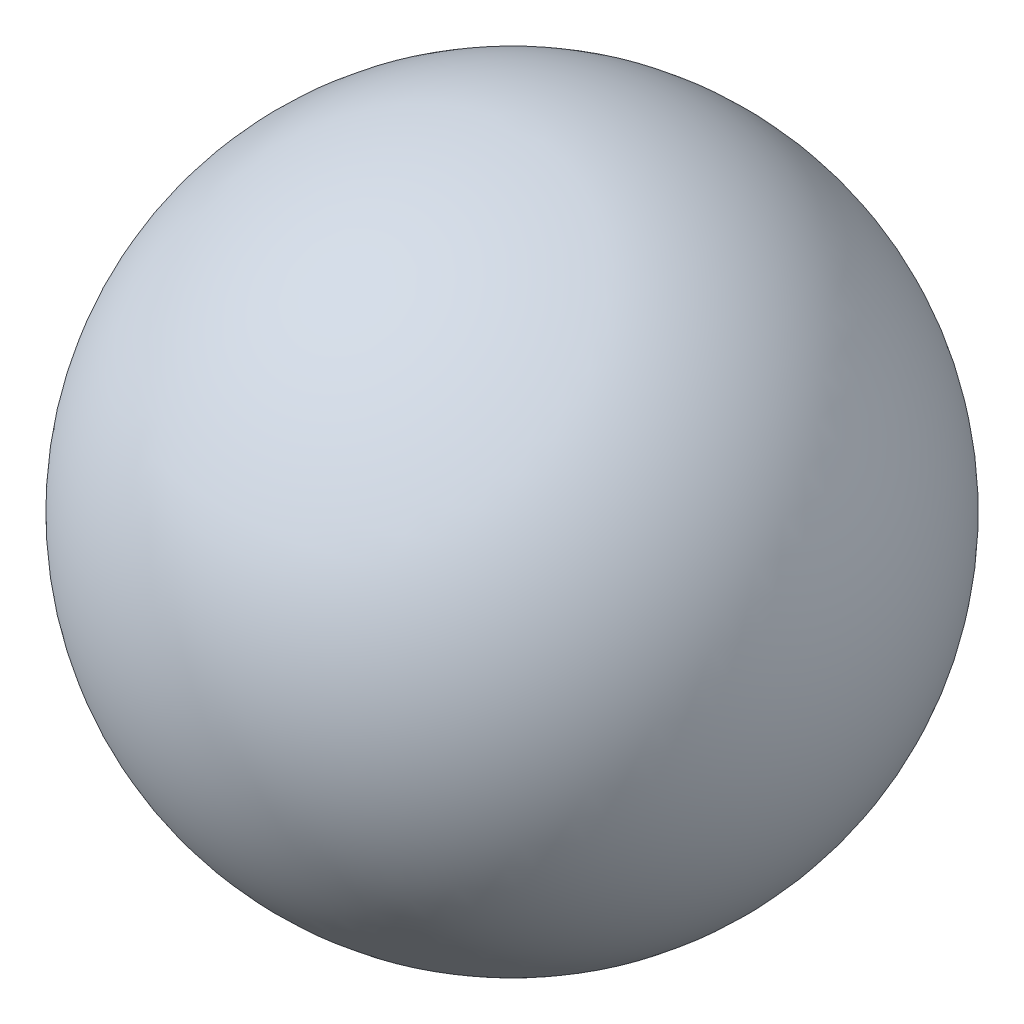
ISO-10303-21;
HEADER;
FILE_DESCRIPTION(('STEP AP214'),'2;1');
FILE_NAME('part.step','',(''),(''),'','','');
FILE_SCHEMA(('AUTOMOTIVE_DESIGN { 1 0 10303 214 1 1 1 1 }'));
ENDSEC;
DATA;
#1=APPLICATION_CONTEXT('core data for automotive mechanical design processes');
#2=APPLICATION_PROTOCOL_DEFINITION('international standard','automotive_design',2000,#1);
#3=PRODUCT_CONTEXT('',#1,'mechanical');
#4=PRODUCT('Part','Part','',(#3));
#5=PRODUCT_RELATED_PRODUCT_CATEGORY('part','',(#4));
#6=PRODUCT_DEFINITION_FORMATION('','',#4);
#7=PRODUCT_DEFINITION_CONTEXT('part definition',#1,'design');
#8=PRODUCT_DEFINITION('design','',#6,#7);
#9=PRODUCT_DEFINITION_SHAPE('','',#8);
#10=(LENGTH_UNIT() NAMED_UNIT(*) SI_UNIT(.MILLI.,.METRE.));
#11=(NAMED_UNIT(*) PLANE_ANGLE_UNIT() SI_UNIT($,.RADIAN.));
#12=(NAMED_UNIT(*) SI_UNIT($,.STERADIAN.) SOLID_ANGLE_UNIT());
#13=UNCERTAINTY_MEASURE_WITH_UNIT(LENGTH_MEASURE(1.E-05),#10,'distance_accuracy_value','');
#14=(GEOMETRIC_REPRESENTATION_CONTEXT(3) GLOBAL_UNCERTAINTY_ASSIGNED_CONTEXT((#13)) GLOBAL_UNIT_ASSIGNED_CONTEXT((#10,
#11,#12)) REPRESENTATION_CONTEXT('',''));
#15=CARTESIAN_POINT('',(0.,0.,0.));
#16=DIRECTION('',(0.,0.,1.));
#17=DIRECTION('',(1.,0.,0.));
#18=AXIS2_PLACEMENT_3D('',#15,#16,#17);
#19=CARTESIAN_POINT('',(0.,0.,0.));
#20=DIRECTION('',(0.,1.,0.));
#21=DIRECTION('',(1.,0.,0.));
#22=AXIS2_PLACEMENT_3D('',#19,#20,#21);
#23=SPHERICAL_SURFACE('',#22,36.5);
#24=CARTESIAN_POINT('',(0.,36.5,0.));
#25=VERTEX_POINT('',#24);
#26=VERTEX_LOOP('',#25);
#27=FACE_BOUND('',#26,.T.);
#28=ADVANCED_FACE('F30',(#27),#23,.T.);
#29=CLOSED_SHELL('',(#28));
#30=CARTESIAN_POINT('',(0.,0.,0.));
#31=DIRECTION('',(0.,1.,0.));
#32=DIRECTION('',(1.,0.,0.));
#33=AXIS2_PLACEMENT_3D('',#30,#31,#32);
#34=SPHERICAL_SURFACE('',#33,34.1);
#35=CARTESIAN_POINT('',(0.,34.1,0.));
#36=VERTEX_POINT('',#35);
#37=VERTEX_LOOP('',#36);
#38=FACE_BOUND('',#37,.T.);
#39=ADVANCED_FACE('F32',(#38),#34,.F.);
#40=CLOSED_SHELL('',(#39));
#41=ORIENTED_CLOSED_SHELL('',*,#40,.T.);
#42=BREP_WITH_VOIDS('B2',#29,(#41));
#43=ADVANCED_BREP_SHAPE_REPRESENTATION('',(#18,#42),#14);
#44=SHAPE_DEFINITION_REPRESENTATION(#9,#43);
ENDSEC;
END-ISO-10303-21;
